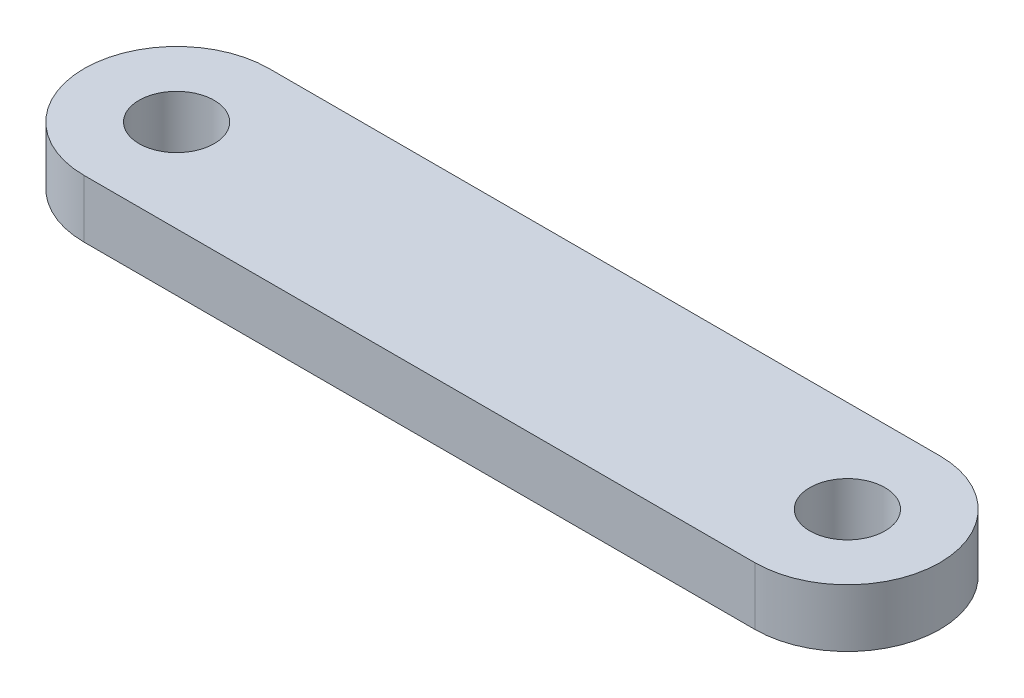
ISO-10303-21;
HEADER;
FILE_DESCRIPTION(('STEP AP214'),'2;1');
FILE_NAME('part.step','',(''),(''),'','','');
FILE_SCHEMA(('AUTOMOTIVE_DESIGN { 1 0 10303 214 1 1 1 1 }'));
ENDSEC;
DATA;
#1=APPLICATION_CONTEXT('core data for automotive mechanical design processes');
#2=APPLICATION_PROTOCOL_DEFINITION('international standard','automotive_design',2000,#1);
#3=PRODUCT_CONTEXT('',#1,'mechanical');
#4=PRODUCT('Part','Part','',(#3));
#5=PRODUCT_RELATED_PRODUCT_CATEGORY('part','',(#4));
#6=PRODUCT_DEFINITION_FORMATION('','',#4);
#7=PRODUCT_DEFINITION_CONTEXT('part definition',#1,'design');
#8=PRODUCT_DEFINITION('design','',#6,#7);
#9=PRODUCT_DEFINITION_SHAPE('','',#8);
#10=(LENGTH_UNIT() NAMED_UNIT(*) SI_UNIT(.MILLI.,.METRE.));
#11=(NAMED_UNIT(*) PLANE_ANGLE_UNIT() SI_UNIT($,.RADIAN.));
#12=(NAMED_UNIT(*) SI_UNIT($,.STERADIAN.) SOLID_ANGLE_UNIT());
#13=UNCERTAINTY_MEASURE_WITH_UNIT(LENGTH_MEASURE(1.E-05),#10,'distance_accuracy_value','');
#14=(GEOMETRIC_REPRESENTATION_CONTEXT(3) GLOBAL_UNCERTAINTY_ASSIGNED_CONTEXT((#13)) GLOBAL_UNIT_ASSIGNED_CONTEXT((#10,
#11,#12)) REPRESENTATION_CONTEXT('',''));
#15=CARTESIAN_POINT('',(0.,0.,0.));
#16=DIRECTION('',(0.,0.,1.));
#17=DIRECTION('',(1.,0.,0.));
#18=AXIS2_PLACEMENT_3D('',#15,#16,#17);
#19=CARTESIAN_POINT('',(0.,2.5,0.));
#20=DIRECTION('',(0.,-1.,0.));
#21=DIRECTION('',(0.,0.,-1.));
#22=AXIS2_PLACEMENT_3D('',#19,#20,#21);
#23=CYLINDRICAL_SURFACE('',#22,4.);
#24=CARTESIAN_POINT('',(0.,0.,0.));
#25=DIRECTION('',(0.,1.,0.));
#26=DIRECTION('',(0.,0.,1.));
#27=AXIS2_PLACEMENT_3D('',#24,#25,#26);
#28=CIRCLE('',#27,4.);
#29=CARTESIAN_POINT('',(0.,0.,-4.));
#30=VERTEX_POINT('',#29);
#31=CARTESIAN_POINT('',(0.,0.,4.));
#32=VERTEX_POINT('',#31);
#33=EDGE_CURVE('E96',#30,#32,#28,.T.);
#34=ORIENTED_EDGE('',*,*,#33,.T.);
#35=DIRECTION('',(0.,-1.,0.));
#36=VECTOR('',#35,1.);
#37=CARTESIAN_POINT('',(0.,2.5,4.));
#38=LINE('',#37,#36);
#39=CARTESIAN_POINT('',(0.,2.5,4.));
#40=VERTEX_POINT('',#39);
#41=EDGE_CURVE('E11',#40,#32,#38,.T.);
#42=ORIENTED_EDGE('',*,*,#41,.F.);
#43=CARTESIAN_POINT('',(0.,2.5,0.));
#44=DIRECTION('',(0.,1.,0.));
#45=DIRECTION('',(0.,0.,1.));
#46=AXIS2_PLACEMENT_3D('',#43,#44,#45);
#47=CIRCLE('',#46,4.);
#48=CARTESIAN_POINT('',(0.,2.5,-4.));
#49=VERTEX_POINT('',#48);
#50=EDGE_CURVE('E84',#49,#40,#47,.T.);
#51=ORIENTED_EDGE('',*,*,#50,.F.);
#52=DIRECTION('',(0.,-1.,0.));
#53=VECTOR('',#52,1.);
#54=CARTESIAN_POINT('',(0.,2.5,-4.));
#55=LINE('',#54,#53);
#56=EDGE_CURVE('E92',#49,#30,#55,.T.);
#57=ORIENTED_EDGE('',*,*,#56,.T.);
#58=EDGE_LOOP('',(#34,#42,#51,#57));
#59=FACE_BOUND('',#58,.T.);
#60=ADVANCED_FACE('F33',(#59),#23,.T.);
#61=CARTESIAN_POINT('',(0.,2.5,4.));
#62=DIRECTION('',(0.,0.,-1.));
#63=DIRECTION('',(-1.,0.,0.));
#64=AXIS2_PLACEMENT_3D('',#61,#62,#63);
#65=PLANE('',#64);
#66=DIRECTION('',(1.,0.,0.));
#67=VECTOR('',#66,1.);
#68=CARTESIAN_POINT('',(0.,0.,4.));
#69=LINE('',#68,#67);
#70=CARTESIAN_POINT('',(29.,0.,4.));
#71=VERTEX_POINT('',#70);
#72=EDGE_CURVE('E88',#32,#71,#69,.T.);
#73=ORIENTED_EDGE('',*,*,#72,.T.);
#74=DIRECTION('',(0.,-1.,0.));
#75=VECTOR('',#74,1.);
#76=CARTESIAN_POINT('',(29.,2.5,4.));
#77=LINE('',#76,#75);
#78=CARTESIAN_POINT('',(29.,2.5,4.));
#79=VERTEX_POINT('',#78);
#80=EDGE_CURVE('E41',#79,#71,#77,.T.);
#81=ORIENTED_EDGE('',*,*,#80,.F.);
#82=DIRECTION('',(1.,0.,0.));
#83=VECTOR('',#82,1.);
#84=CARTESIAN_POINT('',(0.,2.5,4.));
#85=LINE('',#84,#83);
#86=EDGE_CURVE('E79',#40,#79,#85,.T.);
#87=ORIENTED_EDGE('',*,*,#86,.F.);
#88=ORIENTED_EDGE('',*,*,#41,.T.);
#89=EDGE_LOOP('',(#73,#81,#87,#88));
#90=FACE_BOUND('',#89,.T.);
#91=ADVANCED_FACE('F87',(#90),#65,.F.);
#92=CARTESIAN_POINT('',(29.,2.5,0.));
#93=DIRECTION('',(0.,-1.,0.));
#94=DIRECTION('',(0.,0.,-1.));
#95=AXIS2_PLACEMENT_3D('',#92,#93,#94);
#96=CYLINDRICAL_SURFACE('',#95,4.);
#97=CARTESIAN_POINT('',(29.,0.,0.));
#98=DIRECTION('',(0.,1.,0.));
#99=DIRECTION('',(0.,0.,1.));
#100=AXIS2_PLACEMENT_3D('',#97,#98,#99);
#101=CIRCLE('',#100,4.);
#102=CARTESIAN_POINT('',(29.,0.,-4.));
#103=VERTEX_POINT('',#102);
#104=EDGE_CURVE('E66',#71,#103,#101,.T.);
#105=ORIENTED_EDGE('',*,*,#104,.T.);
#106=DIRECTION('',(0.,-1.,0.));
#107=VECTOR('',#106,1.);
#108=CARTESIAN_POINT('',(29.,2.5,-4.));
#109=LINE('',#108,#107);
#110=CARTESIAN_POINT('',(29.,2.5,-4.));
#111=VERTEX_POINT('',#110);
#112=EDGE_CURVE('E89',#111,#103,#109,.T.);
#113=ORIENTED_EDGE('',*,*,#112,.F.);
#114=CARTESIAN_POINT('',(29.,2.5,0.));
#115=DIRECTION('',(0.,1.,0.));
#116=DIRECTION('',(0.,0.,1.));
#117=AXIS2_PLACEMENT_3D('',#114,#115,#116);
#118=CIRCLE('',#117,4.);
#119=EDGE_CURVE('E82',#79,#111,#118,.T.);
#120=ORIENTED_EDGE('',*,*,#119,.F.);
#121=ORIENTED_EDGE('',*,*,#80,.T.);
#122=EDGE_LOOP('',(#105,#113,#120,#121));
#123=FACE_BOUND('',#122,.T.);
#124=ADVANCED_FACE('F90',(#123),#96,.T.);
#125=CARTESIAN_POINT('',(0.,2.5,-4.));
#126=DIRECTION('',(0.,0.,1.));
#127=DIRECTION('',(1.,0.,0.));
#128=AXIS2_PLACEMENT_3D('',#125,#126,#127);
#129=PLANE('',#128);
#130=DIRECTION('',(-1.,0.,0.));
#131=VECTOR('',#130,1.);
#132=CARTESIAN_POINT('',(0.,0.,-4.));
#133=LINE('',#132,#131);
#134=EDGE_CURVE('E72',#103,#30,#133,.T.);
#135=ORIENTED_EDGE('',*,*,#134,.T.);
#136=ORIENTED_EDGE('',*,*,#56,.F.);
#137=DIRECTION('',(-1.,0.,0.));
#138=VECTOR('',#137,1.);
#139=CARTESIAN_POINT('',(0.,2.5,-4.));
#140=LINE('',#139,#138);
#141=EDGE_CURVE('E49',#111,#49,#140,.T.);
#142=ORIENTED_EDGE('',*,*,#141,.F.);
#143=ORIENTED_EDGE('',*,*,#112,.T.);
#144=EDGE_LOOP('',(#135,#136,#142,#143));
#145=FACE_BOUND('',#144,.T.);
#146=ADVANCED_FACE('F104',(#145),#129,.F.);
#147=CARTESIAN_POINT('',(0.,2.5,0.));
#148=DIRECTION('',(0.,1.,0.));
#149=DIRECTION('',(0.,0.,1.));
#150=AXIS2_PLACEMENT_3D('',#147,#148,#149);
#151=PLANE('',#150);
#152=CARTESIAN_POINT('',(29.,2.5,0.));
#153=DIRECTION('',(0.,1.,0.));
#154=DIRECTION('',(0.,0.,1.));
#155=AXIS2_PLACEMENT_3D('',#152,#153,#154);
#156=CIRCLE('',#155,1.625);
#157=CARTESIAN_POINT('',(29.,2.5,1.625));
#158=VERTEX_POINT('',#157);
#159=EDGE_CURVE('E118',#158,#158,#156,.T.);
#160=ORIENTED_EDGE('',*,*,#159,.F.);
#161=EDGE_LOOP('',(#160));
#162=FACE_BOUND('',#161,.T.);
#163=CARTESIAN_POINT('',(0.,2.5,0.));
#164=DIRECTION('',(0.,1.,0.));
#165=DIRECTION('',(0.,0.,1.));
#166=AXIS2_PLACEMENT_3D('',#163,#164,#165);
#167=CIRCLE('',#166,1.625);
#168=CARTESIAN_POINT('',(0.,2.5,1.625));
#169=VERTEX_POINT('',#168);
#170=EDGE_CURVE('E112',#169,#169,#167,.T.);
#171=ORIENTED_EDGE('',*,*,#170,.F.);
#172=EDGE_LOOP('',(#171));
#173=FACE_BOUND('',#172,.T.);
#174=ORIENTED_EDGE('',*,*,#50,.T.);
#175=ORIENTED_EDGE('',*,*,#86,.T.);
#176=ORIENTED_EDGE('',*,*,#119,.T.);
#177=ORIENTED_EDGE('',*,*,#141,.T.);
#178=EDGE_LOOP('',(#174,#175,#176,#177));
#179=FACE_BOUND('',#178,.T.);
#180=ADVANCED_FACE('F80',(#162,#173,#179),#151,.T.);
#181=CARTESIAN_POINT('',(0.,0.,0.));
#182=DIRECTION('',(0.,1.,0.));
#183=DIRECTION('',(0.,0.,1.));
#184=AXIS2_PLACEMENT_3D('',#181,#182,#183);
#185=PLANE('',#184);
#186=CARTESIAN_POINT('',(29.,0.,0.));
#187=DIRECTION('',(0.,1.,0.));
#188=DIRECTION('',(0.,0.,1.));
#189=AXIS2_PLACEMENT_3D('',#186,#187,#188);
#190=CIRCLE('',#189,1.625);
#191=CARTESIAN_POINT('',(29.,0.,1.625));
#192=VERTEX_POINT('',#191);
#193=EDGE_CURVE('E115',#192,#192,#190,.F.);
#194=ORIENTED_EDGE('',*,*,#193,.F.);
#195=EDGE_LOOP('',(#194));
#196=FACE_BOUND('',#195,.T.);
#197=CARTESIAN_POINT('',(0.,0.,0.));
#198=DIRECTION('',(0.,1.,0.));
#199=DIRECTION('',(0.,0.,1.));
#200=AXIS2_PLACEMENT_3D('',#197,#198,#199);
#201=CIRCLE('',#200,1.625);
#202=CARTESIAN_POINT('',(0.,0.,1.625));
#203=VERTEX_POINT('',#202);
#204=EDGE_CURVE('E99',#203,#203,#201,.F.);
#205=ORIENTED_EDGE('',*,*,#204,.F.);
#206=EDGE_LOOP('',(#205));
#207=FACE_BOUND('',#206,.T.);
#208=ORIENTED_EDGE('',*,*,#33,.F.);
#209=ORIENTED_EDGE('',*,*,#134,.F.);
#210=ORIENTED_EDGE('',*,*,#104,.F.);
#211=ORIENTED_EDGE('',*,*,#72,.F.);
#212=EDGE_LOOP('',(#208,#209,#210,#211));
#213=FACE_BOUND('',#212,.T.);
#214=ADVANCED_FACE('F107',(#196,#207,#213),#185,.F.);
#215=CARTESIAN_POINT('',(0.,-4.59619407771256,0.));
#216=DIRECTION('',(0.,1.,0.));
#217=DIRECTION('',(0.,0.,1.));
#218=AXIS2_PLACEMENT_3D('',#215,#216,#217);
#219=CYLINDRICAL_SURFACE('',#218,1.625);
#220=ORIENTED_EDGE('',*,*,#204,.T.);
#221=EDGE_LOOP('',(#220));
#222=FACE_BOUND('',#221,.T.);
#223=ORIENTED_EDGE('',*,*,#170,.T.);
#224=EDGE_LOOP('',(#223));
#225=FACE_BOUND('',#224,.T.);
#226=ADVANCED_FACE('F129',(#222,#225),#219,.F.);
#227=CARTESIAN_POINT('',(29.,-4.59619407771256,0.));
#228=DIRECTION('',(0.,1.,0.));
#229=DIRECTION('',(0.,0.,1.));
#230=AXIS2_PLACEMENT_3D('',#227,#228,#229);
#231=CYLINDRICAL_SURFACE('',#230,1.625);
#232=ORIENTED_EDGE('',*,*,#193,.T.);
#233=EDGE_LOOP('',(#232));
#234=FACE_BOUND('',#233,.T.);
#235=ORIENTED_EDGE('',*,*,#159,.T.);
#236=EDGE_LOOP('',(#235));
#237=FACE_BOUND('',#236,.T.);
#238=ADVANCED_FACE('F122',(#234,#237),#231,.F.);
#239=CLOSED_SHELL('',(#60,#91,#124,#146,#180,#214,#226,#238));
#240=MANIFOLD_SOLID_BREP('B2',#239);
#241=ADVANCED_BREP_SHAPE_REPRESENTATION('',(#18,#240),#14);
#242=SHAPE_DEFINITION_REPRESENTATION(#9,#241);
ENDSEC;
END-ISO-10303-21;
